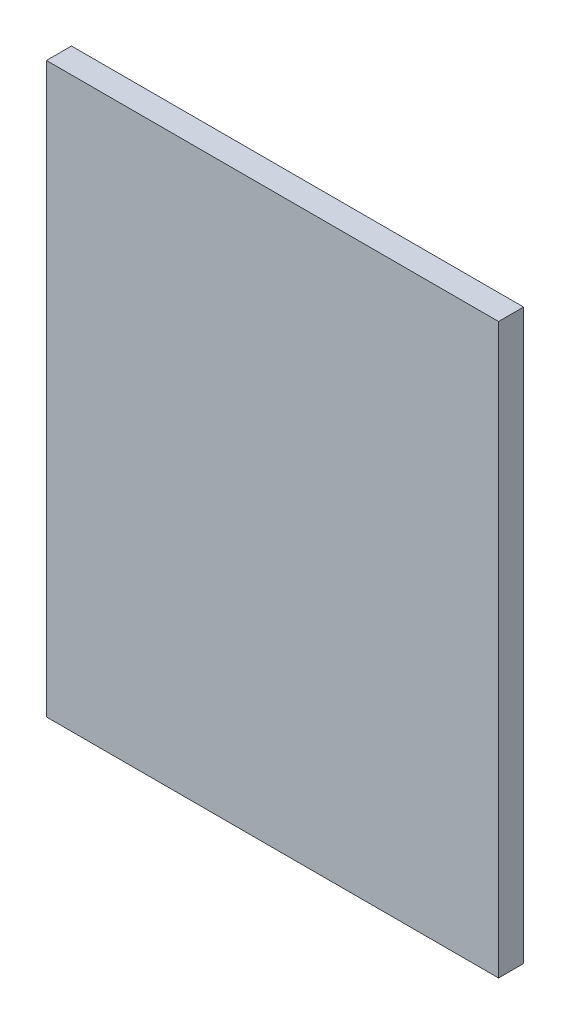
ISO-10303-21;
HEADER;
FILE_DESCRIPTION(('STEP AP214'),'2;1');
FILE_NAME('part.step','',(''),(''),'','','');
FILE_SCHEMA(('AUTOMOTIVE_DESIGN { 1 0 10303 214 1 1 1 1 }'));
ENDSEC;
DATA;
#1=APPLICATION_CONTEXT('core data for automotive mechanical design processes');
#2=APPLICATION_PROTOCOL_DEFINITION('international standard','automotive_design',2000,#1);
#3=PRODUCT_CONTEXT('',#1,'mechanical');
#4=PRODUCT('Part','Part','',(#3));
#5=PRODUCT_RELATED_PRODUCT_CATEGORY('part','',(#4));
#6=PRODUCT_DEFINITION_FORMATION('','',#4);
#7=PRODUCT_DEFINITION_CONTEXT('part definition',#1,'design');
#8=PRODUCT_DEFINITION('design','',#6,#7);
#9=PRODUCT_DEFINITION_SHAPE('','',#8);
#10=(LENGTH_UNIT() NAMED_UNIT(*) SI_UNIT(.MILLI.,.METRE.));
#11=(NAMED_UNIT(*) PLANE_ANGLE_UNIT() SI_UNIT($,.RADIAN.));
#12=(NAMED_UNIT(*) SI_UNIT($,.STERADIAN.) SOLID_ANGLE_UNIT());
#13=UNCERTAINTY_MEASURE_WITH_UNIT(LENGTH_MEASURE(1.E-05),#10,'distance_accuracy_value','');
#14=(GEOMETRIC_REPRESENTATION_CONTEXT(3) GLOBAL_UNCERTAINTY_ASSIGNED_CONTEXT((#13)) GLOBAL_UNIT_ASSIGNED_CONTEXT((#10,
#11,#12)) REPRESENTATION_CONTEXT('',''));
#15=CARTESIAN_POINT('',(0.,0.,0.));
#16=DIRECTION('',(0.,0.,1.));
#17=DIRECTION('',(1.,0.,0.));
#18=AXIS2_PLACEMENT_3D('',#15,#16,#17);
#19=CARTESIAN_POINT('',(6.6,8.3,0.03429));
#20=DIRECTION('',(0.,0.,1.));
#21=DIRECTION('',(0.,-1.,0.));
#22=AXIS2_PLACEMENT_3D('',#19,#20,#21);
#23=PLANE('',#22);
#24=DIRECTION('',(1.,0.,0.));
#25=VECTOR('',#24,1.);
#26=CARTESIAN_POINT('',(13.2,16.6,0.03429));
#27=LINE('',#26,#25);
#28=CARTESIAN_POINT('',(13.2,16.6,0.03429));
#29=VERTEX_POINT('',#28);
#30=CARTESIAN_POINT('',(0.,16.6,0.03429));
#31=VERTEX_POINT('',#30);
#32=EDGE_CURVE('E80',#29,#31,#27,.F.);
#33=ORIENTED_EDGE('',*,*,#32,.F.);
#34=DIRECTION('',(0.,1.,0.));
#35=VECTOR('',#34,1.);
#36=CARTESIAN_POINT('',(13.2,0.,0.03429));
#37=LINE('',#36,#35);
#38=CARTESIAN_POINT('',(13.2,0.,0.03429));
#39=VERTEX_POINT('',#38);
#40=EDGE_CURVE('E68',#39,#29,#37,.T.);
#41=ORIENTED_EDGE('',*,*,#40,.F.);
#42=DIRECTION('',(1.,0.,0.));
#43=VECTOR('',#42,1.);
#44=CARTESIAN_POINT('',(0.,0.,0.03429));
#45=LINE('',#44,#43);
#46=CARTESIAN_POINT('',(0.,0.,0.03429));
#47=VERTEX_POINT('',#46);
#48=EDGE_CURVE('E55',#47,#39,#45,.T.);
#49=ORIENTED_EDGE('',*,*,#48,.F.);
#50=DIRECTION('',(0.,1.,0.));
#51=VECTOR('',#50,1.);
#52=CARTESIAN_POINT('',(0.,16.6,0.03429));
#53=LINE('',#52,#51);
#54=EDGE_CURVE('E20',#31,#47,#53,.F.);
#55=ORIENTED_EDGE('',*,*,#54,.F.);
#56=EDGE_LOOP('',(#33,#41,#49,#55));
#57=FACE_BOUND('',#56,.T.);
#58=ADVANCED_FACE('F17',(#57),#23,.F.);
#59=CARTESIAN_POINT('',(0.,16.6,0.03429));
#60=DIRECTION('',(-1.,0.,0.));
#61=DIRECTION('',(0.,0.,1.));
#62=AXIS2_PLACEMENT_3D('',#59,#60,#61);
#63=PLANE('',#62);
#64=ORIENTED_EDGE('',*,*,#54,.T.);
#65=DIRECTION('',(0.,0.,-1.));
#66=VECTOR('',#65,1.);
#67=CARTESIAN_POINT('',(0.,0.,0.03429));
#68=LINE('',#67,#66);
#69=CARTESIAN_POINT('',(0.,0.,0.76487));
#70=VERTEX_POINT('',#69);
#71=EDGE_CURVE('E61',#70,#47,#68,.T.);
#72=ORIENTED_EDGE('',*,*,#71,.F.);
#73=DIRECTION('',(0.,-1.,0.));
#74=VECTOR('',#73,1.);
#75=CARTESIAN_POINT('',(0.,8.3,0.76487));
#76=LINE('',#75,#74);
#77=CARTESIAN_POINT('',(0.,16.6,0.76487));
#78=VERTEX_POINT('',#77);
#79=EDGE_CURVE('E83',#78,#70,#76,.T.);
#80=ORIENTED_EDGE('',*,*,#79,.F.);
#81=DIRECTION('',(0.,0.,1.));
#82=VECTOR('',#81,1.);
#83=CARTESIAN_POINT('',(0.,16.6,0.03429));
#84=LINE('',#83,#82);
#85=EDGE_CURVE('E64',#31,#78,#84,.T.);
#86=ORIENTED_EDGE('',*,*,#85,.F.);
#87=EDGE_LOOP('',(#64,#72,#80,#86));
#88=FACE_BOUND('',#87,.T.);
#89=ADVANCED_FACE('F60',(#88),#63,.T.);
#90=CARTESIAN_POINT('',(0.,0.,0.03429));
#91=DIRECTION('',(0.,-1.,0.));
#92=DIRECTION('',(0.,0.,-1.));
#93=AXIS2_PLACEMENT_3D('',#90,#91,#92);
#94=PLANE('',#93);
#95=ORIENTED_EDGE('',*,*,#48,.T.);
#96=DIRECTION('',(0.,0.,1.));
#97=VECTOR('',#96,1.);
#98=CARTESIAN_POINT('',(13.2,0.,0.03429));
#99=LINE('',#98,#97);
#100=CARTESIAN_POINT('',(13.2,0.,0.76487));
#101=VERTEX_POINT('',#100);
#102=EDGE_CURVE('E70',#101,#39,#99,.F.);
#103=ORIENTED_EDGE('',*,*,#102,.F.);
#104=DIRECTION('',(1.,0.,0.));
#105=VECTOR('',#104,1.);
#106=CARTESIAN_POINT('',(6.6,0.,0.76487));
#107=LINE('',#106,#105);
#108=EDGE_CURVE('E74',#70,#101,#107,.T.);
#109=ORIENTED_EDGE('',*,*,#108,.F.);
#110=ORIENTED_EDGE('',*,*,#71,.T.);
#111=EDGE_LOOP('',(#95,#103,#109,#110));
#112=FACE_BOUND('',#111,.T.);
#113=ADVANCED_FACE('F72',(#112),#94,.T.);
#114=CARTESIAN_POINT('',(13.2,0.,0.03429));
#115=DIRECTION('',(1.,0.,0.));
#116=DIRECTION('',(0.,1.,0.));
#117=AXIS2_PLACEMENT_3D('',#114,#115,#116);
#118=PLANE('',#117);
#119=ORIENTED_EDGE('',*,*,#40,.T.);
#120=DIRECTION('',(0.,0.,1.));
#121=VECTOR('',#120,1.);
#122=CARTESIAN_POINT('',(13.2,16.6,0.03429));
#123=LINE('',#122,#121);
#124=CARTESIAN_POINT('',(13.2,16.6,0.76487));
#125=VERTEX_POINT('',#124);
#126=EDGE_CURVE('E35',#125,#29,#123,.F.);
#127=ORIENTED_EDGE('',*,*,#126,.F.);
#128=DIRECTION('',(0.,-1.,0.));
#129=VECTOR('',#128,1.);
#130=CARTESIAN_POINT('',(13.2,8.3,0.76487));
#131=LINE('',#130,#129);
#132=EDGE_CURVE('E26',#101,#125,#131,.F.);
#133=ORIENTED_EDGE('',*,*,#132,.F.);
#134=ORIENTED_EDGE('',*,*,#102,.T.);
#135=EDGE_LOOP('',(#119,#127,#133,#134));
#136=FACE_BOUND('',#135,.T.);
#137=ADVANCED_FACE('F89',(#136),#118,.T.);
#138=CARTESIAN_POINT('',(13.2,16.6,0.03429));
#139=DIRECTION('',(0.,1.,0.));
#140=DIRECTION('',(0.,0.,1.));
#141=AXIS2_PLACEMENT_3D('',#138,#139,#140);
#142=PLANE('',#141);
#143=ORIENTED_EDGE('',*,*,#32,.T.);
#144=ORIENTED_EDGE('',*,*,#85,.T.);
#145=DIRECTION('',(1.,0.,0.));
#146=VECTOR('',#145,1.);
#147=CARTESIAN_POINT('',(6.6,16.6,0.76487));
#148=LINE('',#147,#146);
#149=EDGE_CURVE('E11',#125,#78,#148,.F.);
#150=ORIENTED_EDGE('',*,*,#149,.F.);
#151=ORIENTED_EDGE('',*,*,#126,.T.);
#152=EDGE_LOOP('',(#143,#144,#150,#151));
#153=FACE_BOUND('',#152,.T.);
#154=ADVANCED_FACE('F91',(#153),#142,.T.);
#155=CARTESIAN_POINT('',(6.6,8.3,0.76487));
#156=DIRECTION('',(0.,0.,1.));
#157=DIRECTION('',(0.,-1.,0.));
#158=AXIS2_PLACEMENT_3D('',#155,#156,#157);
#159=PLANE('',#158);
#160=ORIENTED_EDGE('',*,*,#132,.T.);
#161=ORIENTED_EDGE('',*,*,#149,.T.);
#162=ORIENTED_EDGE('',*,*,#79,.T.);
#163=ORIENTED_EDGE('',*,*,#108,.T.);
#164=EDGE_LOOP('',(#160,#161,#162,#163));
#165=FACE_BOUND('',#164,.T.);
#166=ADVANCED_FACE('F88',(#165),#159,.T.);
#167=CLOSED_SHELL('',(#58,#89,#113,#137,#154,#166));
#168=MANIFOLD_SOLID_BREP('B1',#167);
#169=ADVANCED_BREP_SHAPE_REPRESENTATION('',(#18,#168),#14);
#170=SHAPE_DEFINITION_REPRESENTATION(#9,#169);
ENDSEC;
END-ISO-10303-21;
